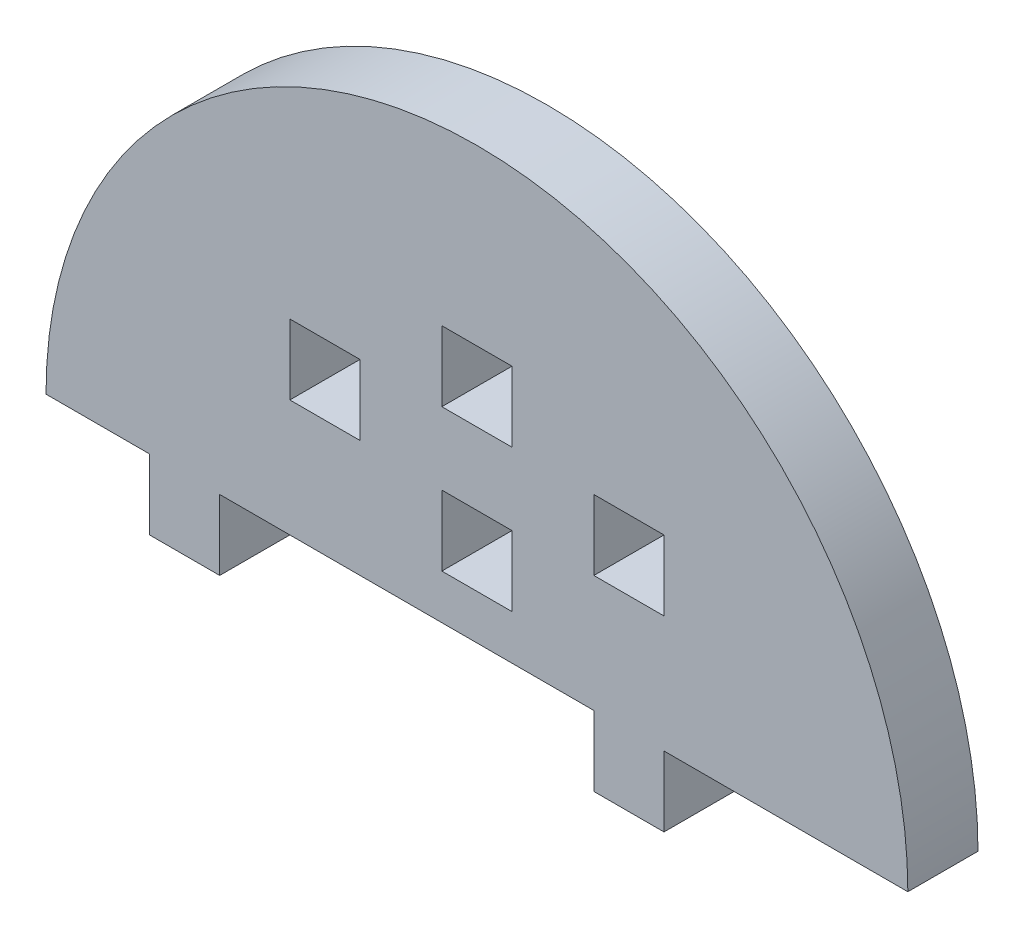
ISO-10303-21;
HEADER;
FILE_DESCRIPTION(('STEP AP214'),'2;1');
FILE_NAME('part.step','',(''),(''),'','','');
FILE_SCHEMA(('AUTOMOTIVE_DESIGN { 1 0 10303 214 1 1 1 1 }'));
ENDSEC;
DATA;
#1=APPLICATION_CONTEXT('core data for automotive mechanical design processes');
#2=APPLICATION_PROTOCOL_DEFINITION('international standard','automotive_design',2000,#1);
#3=PRODUCT_CONTEXT('',#1,'mechanical');
#4=PRODUCT('Part','Part','',(#3));
#5=PRODUCT_RELATED_PRODUCT_CATEGORY('part','',(#4));
#6=PRODUCT_DEFINITION_FORMATION('','',#4);
#7=PRODUCT_DEFINITION_CONTEXT('part definition',#1,'design');
#8=PRODUCT_DEFINITION('design','',#6,#7);
#9=PRODUCT_DEFINITION_SHAPE('','',#8);
#10=(LENGTH_UNIT() NAMED_UNIT(*) SI_UNIT(.MILLI.,.METRE.));
#11=(NAMED_UNIT(*) PLANE_ANGLE_UNIT() SI_UNIT($,.RADIAN.));
#12=(NAMED_UNIT(*) SI_UNIT($,.STERADIAN.) SOLID_ANGLE_UNIT());
#13=UNCERTAINTY_MEASURE_WITH_UNIT(LENGTH_MEASURE(1.E-05),#10,'distance_accuracy_value','');
#14=(GEOMETRIC_REPRESENTATION_CONTEXT(3) GLOBAL_UNCERTAINTY_ASSIGNED_CONTEXT((#13)) GLOBAL_UNIT_ASSIGNED_CONTEXT((#10,
#11,#12)) REPRESENTATION_CONTEXT('',''));
#15=CARTESIAN_POINT('',(0.,0.,0.));
#16=DIRECTION('',(0.,0.,1.));
#17=DIRECTION('',(1.,0.,0.));
#18=AXIS2_PLACEMENT_3D('',#15,#16,#17);
#19=CARTESIAN_POINT('',(3418.74409993076,1203.66051271851,6.));
#20=DIRECTION('',(0.,0.,1.));
#21=DIRECTION('',(1.,0.,0.));
#22=AXIS2_PLACEMENT_3D('',#19,#20,#21);
#23=PLANE('',#22);
#24=DIRECTION('',(0.,1.,0.));
#25=VECTOR('',#24,1.);
#26=CARTESIAN_POINT('',(3428.74409993076,0.,6.));
#27=LINE('',#26,#25);
#28=CARTESIAN_POINT('',(3428.74409993076,1213.66051271851,6.));
#29=VERTEX_POINT('',#28);
#30=CARTESIAN_POINT('',(3428.74409993076,1219.66051271851,6.));
#31=VERTEX_POINT('',#30);
#32=EDGE_CURVE('E393',#29,#31,#27,.T.);
#33=ORIENTED_EDGE('',*,*,#32,.T.);
#34=DIRECTION('',(1.,0.,0.));
#35=VECTOR('',#34,1.);
#36=CARTESIAN_POINT('',(0.,1219.66051271851,6.));
#37=LINE('',#36,#35);
#38=CARTESIAN_POINT('',(3434.74409993076,1219.66051271851,6.));
#39=VERTEX_POINT('',#38);
#40=EDGE_CURVE('E406',#31,#39,#37,.T.);
#41=ORIENTED_EDGE('',*,*,#40,.T.);
#42=DIRECTION('',(0.,-1.,0.));
#43=VECTOR('',#42,1.);
#44=CARTESIAN_POINT('',(3434.74409993076,0.,6.));
#45=LINE('',#44,#43);
#46=CARTESIAN_POINT('',(3434.74409993076,1213.66051271851,6.));
#47=VERTEX_POINT('',#46);
#48=EDGE_CURVE('E223',#39,#47,#45,.T.);
#49=ORIENTED_EDGE('',*,*,#48,.T.);
#50=DIRECTION('',(-1.,0.,0.));
#51=VECTOR('',#50,1.);
#52=CARTESIAN_POINT('',(0.,1213.66051271851,6.));
#53=LINE('',#52,#51);
#54=EDGE_CURVE('E385',#47,#29,#53,.T.);
#55=ORIENTED_EDGE('',*,*,#54,.T.);
#56=EDGE_LOOP('',(#33,#41,#49,#55));
#57=FACE_BOUND('',#56,.T.);
#58=DIRECTION('',(0.,1.,0.));
#59=VECTOR('',#58,1.);
#60=CARTESIAN_POINT('',(3415.74409993076,0.,6.));
#61=LINE('',#60,#59);
#62=CARTESIAN_POINT('',(3415.74409993076,1219.66051271851,6.));
#63=VERTEX_POINT('',#62);
#64=CARTESIAN_POINT('',(3415.74409993076,1225.66051271851,6.));
#65=VERTEX_POINT('',#64);
#66=EDGE_CURVE('E472',#63,#65,#61,.T.);
#67=ORIENTED_EDGE('',*,*,#66,.T.);
#68=DIRECTION('',(1.,0.,0.));
#69=VECTOR('',#68,1.);
#70=CARTESIAN_POINT('',(0.,1225.66051271851,6.));
#71=LINE('',#70,#69);
#72=CARTESIAN_POINT('',(3421.74409993076,1225.66051271851,6.));
#73=VERTEX_POINT('',#72);
#74=EDGE_CURVE('E485',#65,#73,#71,.T.);
#75=ORIENTED_EDGE('',*,*,#74,.T.);
#76=DIRECTION('',(0.,-1.,0.));
#77=VECTOR('',#76,1.);
#78=CARTESIAN_POINT('',(3421.74409993076,0.,6.));
#79=LINE('',#78,#77);
#80=CARTESIAN_POINT('',(3421.74409993076,1219.66051271851,6.));
#81=VERTEX_POINT('',#80);
#82=EDGE_CURVE('E481',#73,#81,#79,.T.);
#83=ORIENTED_EDGE('',*,*,#82,.T.);
#84=DIRECTION('',(-1.,0.,0.));
#85=VECTOR('',#84,1.);
#86=CARTESIAN_POINT('',(0.,1219.66051271851,6.));
#87=LINE('',#86,#85);
#88=EDGE_CURVE('E476',#81,#63,#87,.T.);
#89=ORIENTED_EDGE('',*,*,#88,.T.);
#90=EDGE_LOOP('',(#67,#75,#83,#89));
#91=FACE_BOUND('',#90,.T.);
#92=DIRECTION('',(1.,0.,0.));
#93=VECTOR('',#92,1.);
#94=CARTESIAN_POINT('',(3434.74409993076,1203.66051271851,6.));
#95=LINE('',#94,#93);
#96=CARTESIAN_POINT('',(3434.74409993076,1203.66051271851,6.));
#97=VERTEX_POINT('',#96);
#98=CARTESIAN_POINT('',(3455.6012427879,1203.66051271851,6.));
#99=VERTEX_POINT('',#98);
#100=EDGE_CURVE('E559',#97,#99,#95,.T.);
#101=ORIENTED_EDGE('',*,*,#100,.T.);
#102=CARTESIAN_POINT('',(3418.74409993076,1203.66051271851,6.));
#103=DIRECTION('',(0.,0.,1.));
#104=DIRECTION('',(1.,0.,0.));
#105=AXIS2_PLACEMENT_3D('',#102,#103,#104);
#106=CIRCLE('',#105,36.8571428571414);
#107=CARTESIAN_POINT('',(3381.88695707362,1203.66051271851,6.));
#108=VERTEX_POINT('',#107);
#109=EDGE_CURVE('E563',#99,#108,#106,.T.);
#110=ORIENTED_EDGE('',*,*,#109,.T.);
#111=DIRECTION('',(-1.,0.,0.));
#112=VECTOR('',#111,1.);
#113=CARTESIAN_POINT('',(3390.74409993076,1203.66051271851,6.));
#114=LINE('',#113,#112);
#115=CARTESIAN_POINT('',(3390.74409993076,1203.66051271851,6.));
#116=VERTEX_POINT('',#115);
#117=EDGE_CURVE('E567',#116,#108,#114,.T.);
#118=ORIENTED_EDGE('',*,*,#117,.F.);
#119=DIRECTION('',(0.,1.,0.));
#120=VECTOR('',#119,1.);
#121=CARTESIAN_POINT('',(3390.74409993076,1197.66051271851,6.));
#122=LINE('',#121,#120);
#123=CARTESIAN_POINT('',(3390.74409993076,1197.66051271851,6.));
#124=VERTEX_POINT('',#123);
#125=EDGE_CURVE('E571',#124,#116,#122,.T.);
#126=ORIENTED_EDGE('',*,*,#125,.F.);
#127=DIRECTION('',(-1.,0.,0.));
#128=VECTOR('',#127,1.);
#129=CARTESIAN_POINT('',(3396.74409993076,1197.66051271851,6.));
#130=LINE('',#129,#128);
#131=CARTESIAN_POINT('',(3396.74409993076,1197.66051271851,6.));
#132=VERTEX_POINT('',#131);
#133=EDGE_CURVE('E575',#132,#124,#130,.T.);
#134=ORIENTED_EDGE('',*,*,#133,.F.);
#135=DIRECTION('',(0.,-1.,0.));
#136=VECTOR('',#135,1.);
#137=CARTESIAN_POINT('',(3396.74409993076,1203.66051271851,6.));
#138=LINE('',#137,#136);
#139=CARTESIAN_POINT('',(3396.74409993076,1203.66051271851,6.));
#140=VERTEX_POINT('',#139);
#141=EDGE_CURVE('E579',#140,#132,#138,.T.);
#142=ORIENTED_EDGE('',*,*,#141,.F.);
#143=DIRECTION('',(1.,0.,0.));
#144=VECTOR('',#143,1.);
#145=CARTESIAN_POINT('',(3396.74409993076,1203.66051271851,6.));
#146=LINE('',#145,#144);
#147=CARTESIAN_POINT('',(3428.74409993076,1203.66051271851,6.));
#148=VERTEX_POINT('',#147);
#149=EDGE_CURVE('E583',#140,#148,#146,.T.);
#150=ORIENTED_EDGE('',*,*,#149,.T.);
#151=DIRECTION('',(0.,-1.,0.));
#152=VECTOR('',#151,1.);
#153=CARTESIAN_POINT('',(3428.74409993076,1203.66051271851,6.));
#154=LINE('',#153,#152);
#155=CARTESIAN_POINT('',(3428.74409993076,1197.66051271851,6.));
#156=VERTEX_POINT('',#155);
#157=EDGE_CURVE('E586',#148,#156,#154,.T.);
#158=ORIENTED_EDGE('',*,*,#157,.T.);
#159=DIRECTION('',(1.,0.,0.));
#160=VECTOR('',#159,1.);
#161=CARTESIAN_POINT('',(3428.74409993076,1197.66051271851,6.));
#162=LINE('',#161,#160);
#163=CARTESIAN_POINT('',(3434.74409993076,1197.66051271851,6.));
#164=VERTEX_POINT('',#163);
#165=EDGE_CURVE('E589',#156,#164,#162,.T.);
#166=ORIENTED_EDGE('',*,*,#165,.T.);
#167=DIRECTION('',(0.,1.,0.));
#168=VECTOR('',#167,1.);
#169=CARTESIAN_POINT('',(3434.74409993076,1197.66051271851,6.));
#170=LINE('',#169,#168);
#171=EDGE_CURVE('E592',#164,#97,#170,.T.);
#172=ORIENTED_EDGE('',*,*,#171,.T.);
#173=EDGE_LOOP('',(#101,#110,#118,#126,#134,#142,#150,#158,#166,#172));
#174=FACE_BOUND('',#173,.T.);
#175=DIRECTION('',(0.,1.,0.));
#176=VECTOR('',#175,1.);
#177=CARTESIAN_POINT('',(3408.74409993076,0.,6.));
#178=LINE('',#177,#176);
#179=CARTESIAN_POINT('',(3408.74409993076,1213.66051271851,6.));
#180=VERTEX_POINT('',#179);
#181=CARTESIAN_POINT('',(3408.74409993076,1219.66051271851,6.));
#182=VERTEX_POINT('',#181);
#183=EDGE_CURVE('E519',#180,#182,#178,.T.);
#184=ORIENTED_EDGE('',*,*,#183,.F.);
#185=DIRECTION('',(1.,0.,0.));
#186=VECTOR('',#185,1.);
#187=CARTESIAN_POINT('',(0.,1213.66051271851,6.));
#188=LINE('',#187,#186);
#189=CARTESIAN_POINT('',(3402.74409993076,1213.66051271851,6.));
#190=VERTEX_POINT('',#189);
#191=EDGE_CURVE('E516',#190,#180,#188,.T.);
#192=ORIENTED_EDGE('',*,*,#191,.F.);
#193=DIRECTION('',(0.,-1.,0.));
#194=VECTOR('',#193,1.);
#195=CARTESIAN_POINT('',(3402.74409993076,0.,6.));
#196=LINE('',#195,#194);
#197=CARTESIAN_POINT('',(3402.74409993076,1219.66051271851,6.));
#198=VERTEX_POINT('',#197);
#199=EDGE_CURVE('E527',#198,#190,#196,.T.);
#200=ORIENTED_EDGE('',*,*,#199,.F.);
#201=DIRECTION('',(-1.,0.,0.));
#202=VECTOR('',#201,1.);
#203=CARTESIAN_POINT('',(0.,1219.66051271851,6.));
#204=LINE('',#203,#202);
#205=EDGE_CURVE('E523',#182,#198,#204,.T.);
#206=ORIENTED_EDGE('',*,*,#205,.F.);
#207=EDGE_LOOP('',(#184,#192,#200,#206));
#208=FACE_BOUND('',#207,.T.);
#209=DIRECTION('',(0.,-1.,0.));
#210=VECTOR('',#209,1.);
#211=CARTESIAN_POINT('',(3415.74409993076,0.,6.));
#212=LINE('',#211,#210);
#213=CARTESIAN_POINT('',(3415.74409993076,1213.48497155193,6.));
#214=VERTEX_POINT('',#213);
#215=CARTESIAN_POINT('',(3415.74409993076,1207.48497155193,6.));
#216=VERTEX_POINT('',#215);
#217=EDGE_CURVE('E432',#214,#216,#212,.T.);
#218=ORIENTED_EDGE('',*,*,#217,.F.);
#219=DIRECTION('',(-1.,0.,0.));
#220=VECTOR('',#219,1.);
#221=CARTESIAN_POINT('',(0.,1213.48497155193,6.));
#222=LINE('',#221,#220);
#223=CARTESIAN_POINT('',(3421.74409993076,1213.48497155193,6.));
#224=VERTEX_POINT('',#223);
#225=EDGE_CURVE('E429',#224,#214,#222,.T.);
#226=ORIENTED_EDGE('',*,*,#225,.F.);
#227=DIRECTION('',(0.,1.,0.));
#228=VECTOR('',#227,1.);
#229=CARTESIAN_POINT('',(3421.74409993076,0.,6.));
#230=LINE('',#229,#228);
#231=CARTESIAN_POINT('',(3421.74409993076,1207.48497155193,6.));
#232=VERTEX_POINT('',#231);
#233=EDGE_CURVE('E440',#232,#224,#230,.T.);
#234=ORIENTED_EDGE('',*,*,#233,.F.);
#235=DIRECTION('',(1.,0.,0.));
#236=VECTOR('',#235,1.);
#237=CARTESIAN_POINT('',(0.,1207.48497155193,6.));
#238=LINE('',#237,#236);
#239=EDGE_CURVE('E436',#216,#232,#238,.T.);
#240=ORIENTED_EDGE('',*,*,#239,.F.);
#241=EDGE_LOOP('',(#218,#226,#234,#240));
#242=FACE_BOUND('',#241,.T.);
#243=ADVANCED_FACE('F207',(#57,#91,#174,#208,#242),#23,.T.);
#244=CARTESIAN_POINT('',(3418.74409993076,1203.66051271851,0.));
#245=DIRECTION('',(0.,0.,1.));
#246=DIRECTION('',(1.,0.,0.));
#247=AXIS2_PLACEMENT_3D('',#244,#245,#246);
#248=PLANE('',#247);
#249=DIRECTION('',(1.,0.,0.));
#250=VECTOR('',#249,1.);
#251=CARTESIAN_POINT('',(0.,1219.66051271851,0.));
#252=LINE('',#251,#250);
#253=CARTESIAN_POINT('',(3428.74409993076,1219.66051271851,0.));
#254=VERTEX_POINT('',#253);
#255=CARTESIAN_POINT('',(3434.74409993076,1219.66051271851,0.));
#256=VERTEX_POINT('',#255);
#257=EDGE_CURVE('E400',#254,#256,#252,.T.);
#258=ORIENTED_EDGE('',*,*,#257,.F.);
#259=DIRECTION('',(0.,1.,0.));
#260=VECTOR('',#259,1.);
#261=CARTESIAN_POINT('',(3428.74409993076,0.,0.));
#262=LINE('',#261,#260);
#263=CARTESIAN_POINT('',(3428.74409993076,1213.66051271851,0.));
#264=VERTEX_POINT('',#263);
#265=EDGE_CURVE('E231',#264,#254,#262,.T.);
#266=ORIENTED_EDGE('',*,*,#265,.F.);
#267=DIRECTION('',(-1.,0.,0.));
#268=VECTOR('',#267,1.);
#269=CARTESIAN_POINT('',(0.,1213.66051271851,0.));
#270=LINE('',#269,#268);
#271=CARTESIAN_POINT('',(3434.74409993076,1213.66051271851,0.));
#272=VERTEX_POINT('',#271);
#273=EDGE_CURVE('E387',#272,#264,#270,.T.);
#274=ORIENTED_EDGE('',*,*,#273,.F.);
#275=DIRECTION('',(0.,-1.,0.));
#276=VECTOR('',#275,1.);
#277=CARTESIAN_POINT('',(3434.74409993076,0.,0.));
#278=LINE('',#277,#276);
#279=EDGE_CURVE('E415',#256,#272,#278,.T.);
#280=ORIENTED_EDGE('',*,*,#279,.F.);
#281=EDGE_LOOP('',(#258,#266,#274,#280));
#282=FACE_BOUND('',#281,.T.);
#283=DIRECTION('',(1.,0.,0.));
#284=VECTOR('',#283,1.);
#285=CARTESIAN_POINT('',(0.,1213.66051271851,0.));
#286=LINE('',#285,#284);
#287=CARTESIAN_POINT('',(3402.74409993076,1213.66051271851,0.));
#288=VERTEX_POINT('',#287);
#289=CARTESIAN_POINT('',(3408.74409993076,1213.66051271851,0.));
#290=VERTEX_POINT('',#289);
#291=EDGE_CURVE('E515',#288,#290,#286,.T.);
#292=ORIENTED_EDGE('',*,*,#291,.T.);
#293=DIRECTION('',(0.,1.,0.));
#294=VECTOR('',#293,1.);
#295=CARTESIAN_POINT('',(3408.74409993076,0.,0.));
#296=LINE('',#295,#294);
#297=CARTESIAN_POINT('',(3408.74409993076,1219.66051271851,0.));
#298=VERTEX_POINT('',#297);
#299=EDGE_CURVE('E534',#290,#298,#296,.T.);
#300=ORIENTED_EDGE('',*,*,#299,.T.);
#301=DIRECTION('',(-1.,0.,0.));
#302=VECTOR('',#301,1.);
#303=CARTESIAN_POINT('',(0.,1219.66051271851,0.));
#304=LINE('',#303,#302);
#305=CARTESIAN_POINT('',(3402.74409993076,1219.66051271851,0.));
#306=VERTEX_POINT('',#305);
#307=EDGE_CURVE('E538',#298,#306,#304,.T.);
#308=ORIENTED_EDGE('',*,*,#307,.T.);
#309=DIRECTION('',(0.,-1.,0.));
#310=VECTOR('',#309,1.);
#311=CARTESIAN_POINT('',(3402.74409993076,0.,0.));
#312=LINE('',#311,#310);
#313=EDGE_CURVE('E520',#306,#288,#312,.T.);
#314=ORIENTED_EDGE('',*,*,#313,.T.);
#315=EDGE_LOOP('',(#292,#300,#308,#314));
#316=FACE_BOUND('',#315,.T.);
#317=DIRECTION('',(1.,0.,0.));
#318=VECTOR('',#317,1.);
#319=CARTESIAN_POINT('',(3434.74409993076,1203.66051271851,0.));
#320=LINE('',#319,#318);
#321=CARTESIAN_POINT('',(3434.74409993076,1203.66051271851,0.));
#322=VERTEX_POINT('',#321);
#323=CARTESIAN_POINT('',(3455.6012427879,1203.66051271851,0.));
#324=VERTEX_POINT('',#323);
#325=EDGE_CURVE('E558',#322,#324,#320,.T.);
#326=ORIENTED_EDGE('',*,*,#325,.F.);
#327=DIRECTION('',(0.,1.,0.));
#328=VECTOR('',#327,1.);
#329=CARTESIAN_POINT('',(3434.74409993076,1197.66051271851,0.));
#330=LINE('',#329,#328);
#331=CARTESIAN_POINT('',(3434.74409993076,1197.66051271851,0.));
#332=VERTEX_POINT('',#331);
#333=EDGE_CURVE('E564',#332,#322,#330,.T.);
#334=ORIENTED_EDGE('',*,*,#333,.F.);
#335=DIRECTION('',(1.,0.,0.));
#336=VECTOR('',#335,1.);
#337=CARTESIAN_POINT('',(3428.74409993076,1197.66051271851,0.));
#338=LINE('',#337,#336);
#339=CARTESIAN_POINT('',(3428.74409993076,1197.66051271851,0.));
#340=VERTEX_POINT('',#339);
#341=EDGE_CURVE('E625',#340,#332,#338,.T.);
#342=ORIENTED_EDGE('',*,*,#341,.F.);
#343=DIRECTION('',(0.,-1.,0.));
#344=VECTOR('',#343,1.);
#345=CARTESIAN_POINT('',(3428.74409993076,1203.66051271851,0.));
#346=LINE('',#345,#344);
#347=CARTESIAN_POINT('',(3428.74409993076,1203.66051271851,0.));
#348=VERTEX_POINT('',#347);
#349=EDGE_CURVE('E622',#348,#340,#346,.T.);
#350=ORIENTED_EDGE('',*,*,#349,.F.);
#351=DIRECTION('',(1.,0.,0.));
#352=VECTOR('',#351,1.);
#353=CARTESIAN_POINT('',(3396.74409993076,1203.66051271851,0.));
#354=LINE('',#353,#352);
#355=CARTESIAN_POINT('',(3396.74409993076,1203.66051271851,0.));
#356=VERTEX_POINT('',#355);
#357=EDGE_CURVE('E619',#356,#348,#354,.T.);
#358=ORIENTED_EDGE('',*,*,#357,.F.);
#359=DIRECTION('',(0.,-1.,0.));
#360=VECTOR('',#359,1.);
#361=CARTESIAN_POINT('',(3396.74409993076,1203.66051271851,0.));
#362=LINE('',#361,#360);
#363=CARTESIAN_POINT('',(3396.74409993076,1197.66051271851,0.));
#364=VERTEX_POINT('',#363);
#365=EDGE_CURVE('E615',#356,#364,#362,.T.);
#366=ORIENTED_EDGE('',*,*,#365,.T.);
#367=DIRECTION('',(-1.,0.,0.));
#368=VECTOR('',#367,1.);
#369=CARTESIAN_POINT('',(3396.74409993076,1197.66051271851,0.));
#370=LINE('',#369,#368);
#371=CARTESIAN_POINT('',(3390.74409993076,1197.66051271851,0.));
#372=VERTEX_POINT('',#371);
#373=EDGE_CURVE('E611',#364,#372,#370,.T.);
#374=ORIENTED_EDGE('',*,*,#373,.T.);
#375=DIRECTION('',(0.,1.,0.));
#376=VECTOR('',#375,1.);
#377=CARTESIAN_POINT('',(3390.74409993076,1197.66051271851,0.));
#378=LINE('',#377,#376);
#379=CARTESIAN_POINT('',(3390.74409993076,1203.66051271851,0.));
#380=VERTEX_POINT('',#379);
#381=EDGE_CURVE('E607',#372,#380,#378,.T.);
#382=ORIENTED_EDGE('',*,*,#381,.T.);
#383=DIRECTION('',(-1.,0.,0.));
#384=VECTOR('',#383,1.);
#385=CARTESIAN_POINT('',(3390.74409993076,1203.66051271851,0.));
#386=LINE('',#385,#384);
#387=CARTESIAN_POINT('',(3381.88695707362,1203.66051271851,0.));
#388=VERTEX_POINT('',#387);
#389=EDGE_CURVE('E603',#380,#388,#386,.T.);
#390=ORIENTED_EDGE('',*,*,#389,.T.);
#391=CARTESIAN_POINT('',(3418.74409993076,1203.66051271851,0.));
#392=DIRECTION('',(0.,0.,1.));
#393=DIRECTION('',(1.,0.,0.));
#394=AXIS2_PLACEMENT_3D('',#391,#392,#393);
#395=CIRCLE('',#394,36.8571428571414);
#396=EDGE_CURVE('E599',#324,#388,#395,.T.);
#397=ORIENTED_EDGE('',*,*,#396,.F.);
#398=EDGE_LOOP('',(#326,#334,#342,#350,#358,#366,#374,#382,#390,#397));
#399=FACE_BOUND('',#398,.T.);
#400=DIRECTION('',(1.,0.,0.));
#401=VECTOR('',#400,1.);
#402=CARTESIAN_POINT('',(0.,1225.66051271851,0.));
#403=LINE('',#402,#401);
#404=CARTESIAN_POINT('',(3415.74409993076,1225.66051271851,0.));
#405=VERTEX_POINT('',#404);
#406=CARTESIAN_POINT('',(3421.74409993076,1225.66051271851,0.));
#407=VERTEX_POINT('',#406);
#408=EDGE_CURVE('E477',#405,#407,#403,.T.);
#409=ORIENTED_EDGE('',*,*,#408,.F.);
#410=DIRECTION('',(0.,1.,0.));
#411=VECTOR('',#410,1.);
#412=CARTESIAN_POINT('',(3415.74409993076,0.,0.));
#413=LINE('',#412,#411);
#414=CARTESIAN_POINT('',(3415.74409993076,1219.66051271851,0.));
#415=VERTEX_POINT('',#414);
#416=EDGE_CURVE('E471',#415,#405,#413,.T.);
#417=ORIENTED_EDGE('',*,*,#416,.F.);
#418=DIRECTION('',(-1.,0.,0.));
#419=VECTOR('',#418,1.);
#420=CARTESIAN_POINT('',(0.,1219.66051271851,0.));
#421=LINE('',#420,#419);
#422=CARTESIAN_POINT('',(3421.74409993076,1219.66051271851,0.));
#423=VERTEX_POINT('',#422);
#424=EDGE_CURVE('E492',#423,#415,#421,.T.);
#425=ORIENTED_EDGE('',*,*,#424,.F.);
#426=DIRECTION('',(0.,-1.,0.));
#427=VECTOR('',#426,1.);
#428=CARTESIAN_POINT('',(3421.74409993076,0.,0.));
#429=LINE('',#428,#427);
#430=EDGE_CURVE('E496',#407,#423,#429,.T.);
#431=ORIENTED_EDGE('',*,*,#430,.F.);
#432=EDGE_LOOP('',(#409,#417,#425,#431));
#433=FACE_BOUND('',#432,.T.);
#434=DIRECTION('',(-1.,0.,0.));
#435=VECTOR('',#434,1.);
#436=CARTESIAN_POINT('',(0.,1213.48497155193,0.));
#437=LINE('',#436,#435);
#438=CARTESIAN_POINT('',(3421.74409993076,1213.48497155193,0.));
#439=VERTEX_POINT('',#438);
#440=CARTESIAN_POINT('',(3415.74409993076,1213.48497155193,0.));
#441=VERTEX_POINT('',#440);
#442=EDGE_CURVE('E389',#439,#441,#437,.T.);
#443=ORIENTED_EDGE('',*,*,#442,.T.);
#444=DIRECTION('',(0.,-1.,0.));
#445=VECTOR('',#444,1.);
#446=CARTESIAN_POINT('',(3415.74409993076,0.,0.));
#447=LINE('',#446,#445);
#448=CARTESIAN_POINT('',(3415.74409993076,1207.48497155193,0.));
#449=VERTEX_POINT('',#448);
#450=EDGE_CURVE('E447',#441,#449,#447,.T.);
#451=ORIENTED_EDGE('',*,*,#450,.T.);
#452=DIRECTION('',(1.,0.,0.));
#453=VECTOR('',#452,1.);
#454=CARTESIAN_POINT('',(0.,1207.48497155193,0.));
#455=LINE('',#454,#453);
#456=CARTESIAN_POINT('',(3421.74409993076,1207.48497155193,0.));
#457=VERTEX_POINT('',#456);
#458=EDGE_CURVE('E451',#449,#457,#455,.T.);
#459=ORIENTED_EDGE('',*,*,#458,.T.);
#460=DIRECTION('',(0.,1.,0.));
#461=VECTOR('',#460,1.);
#462=CARTESIAN_POINT('',(3421.74409993076,0.,0.));
#463=LINE('',#462,#461);
#464=EDGE_CURVE('E433',#457,#439,#463,.T.);
#465=ORIENTED_EDGE('',*,*,#464,.T.);
#466=EDGE_LOOP('',(#443,#451,#459,#465));
#467=FACE_BOUND('',#466,.T.);
#468=ADVANCED_FACE('F667',(#282,#316,#399,#433,#467),#248,.F.);
#469=CARTESIAN_POINT('',(3434.74409993076,1203.66051271851,6.));
#470=DIRECTION('',(0.,1.,0.));
#471=DIRECTION('',(0.,0.,1.));
#472=AXIS2_PLACEMENT_3D('',#469,#470,#471);
#473=PLANE('',#472);
#474=ORIENTED_EDGE('',*,*,#325,.T.);
#475=DIRECTION('',(0.,0.,-1.));
#476=VECTOR('',#475,1.);
#477=CARTESIAN_POINT('',(3455.6012427879,1203.66051271851,6.));
#478=LINE('',#477,#476);
#479=EDGE_CURVE('E12',#99,#324,#478,.T.);
#480=ORIENTED_EDGE('',*,*,#479,.F.);
#481=ORIENTED_EDGE('',*,*,#100,.F.);
#482=DIRECTION('',(0.,0.,-1.));
#483=VECTOR('',#482,1.);
#484=CARTESIAN_POINT('',(3434.74409993076,1203.66051271851,6.));
#485=LINE('',#484,#483);
#486=EDGE_CURVE('E595',#97,#322,#485,.T.);
#487=ORIENTED_EDGE('',*,*,#486,.T.);
#488=EDGE_LOOP('',(#474,#480,#481,#487));
#489=FACE_BOUND('',#488,.T.);
#490=ADVANCED_FACE('F209',(#489),#473,.F.);
#491=CARTESIAN_POINT('',(3418.74409993076,1203.66051271851,6.));
#492=DIRECTION('',(0.,0.,-1.));
#493=DIRECTION('',(-1.,0.,0.));
#494=AXIS2_PLACEMENT_3D('',#491,#492,#493);
#495=CYLINDRICAL_SURFACE('',#494,36.8571428571414);
#496=ORIENTED_EDGE('',*,*,#396,.T.);
#497=DIRECTION('',(0.,0.,-1.));
#498=VECTOR('',#497,1.);
#499=CARTESIAN_POINT('',(3381.88695707362,1203.66051271851,6.));
#500=LINE('',#499,#498);
#501=EDGE_CURVE('E216',#108,#388,#500,.T.);
#502=ORIENTED_EDGE('',*,*,#501,.F.);
#503=ORIENTED_EDGE('',*,*,#109,.F.);
#504=ORIENTED_EDGE('',*,*,#479,.T.);
#505=EDGE_LOOP('',(#496,#502,#503,#504));
#506=FACE_BOUND('',#505,.T.);
#507=ADVANCED_FACE('F663',(#506),#495,.T.);
#508=CARTESIAN_POINT('',(3390.74409993076,1203.66051271851,6.));
#509=DIRECTION('',(0.,-1.,0.));
#510=DIRECTION('',(0.,0.,-1.));
#511=AXIS2_PLACEMENT_3D('',#508,#509,#510);
#512=PLANE('',#511);
#513=ORIENTED_EDGE('',*,*,#389,.F.);
#514=DIRECTION('',(0.,0.,-1.));
#515=VECTOR('',#514,1.);
#516=CARTESIAN_POINT('',(3390.74409993076,1203.66051271851,6.));
#517=LINE('',#516,#515);
#518=EDGE_CURVE('E654',#116,#380,#517,.T.);
#519=ORIENTED_EDGE('',*,*,#518,.F.);
#520=ORIENTED_EDGE('',*,*,#117,.T.);
#521=ORIENTED_EDGE('',*,*,#501,.T.);
#522=EDGE_LOOP('',(#513,#519,#520,#521));
#523=FACE_BOUND('',#522,.T.);
#524=ADVANCED_FACE('F660',(#523),#512,.T.);
#525=CARTESIAN_POINT('',(3390.74409993076,1197.66051271851,6.));
#526=DIRECTION('',(-1.,0.,0.));
#527=DIRECTION('',(0.,0.,1.));
#528=AXIS2_PLACEMENT_3D('',#525,#526,#527);
#529=PLANE('',#528);
#530=ORIENTED_EDGE('',*,*,#381,.F.);
#531=DIRECTION('',(0.,0.,-1.));
#532=VECTOR('',#531,1.);
#533=CARTESIAN_POINT('',(3390.74409993076,1197.66051271851,6.));
#534=LINE('',#533,#532);
#535=EDGE_CURVE('E651',#124,#372,#534,.T.);
#536=ORIENTED_EDGE('',*,*,#535,.F.);
#537=ORIENTED_EDGE('',*,*,#125,.T.);
#538=ORIENTED_EDGE('',*,*,#518,.T.);
#539=EDGE_LOOP('',(#530,#536,#537,#538));
#540=FACE_BOUND('',#539,.T.);
#541=ADVANCED_FACE('F672',(#540),#529,.T.);
#542=CARTESIAN_POINT('',(3396.74409993076,1197.66051271851,6.));
#543=DIRECTION('',(0.,-1.,0.));
#544=DIRECTION('',(0.,0.,-1.));
#545=AXIS2_PLACEMENT_3D('',#542,#543,#544);
#546=PLANE('',#545);
#547=ORIENTED_EDGE('',*,*,#373,.F.);
#548=DIRECTION('',(0.,0.,-1.));
#549=VECTOR('',#548,1.);
#550=CARTESIAN_POINT('',(3396.74409993076,1197.66051271851,6.));
#551=LINE('',#550,#549);
#552=EDGE_CURVE('E648',#132,#364,#551,.T.);
#553=ORIENTED_EDGE('',*,*,#552,.F.);
#554=ORIENTED_EDGE('',*,*,#133,.T.);
#555=ORIENTED_EDGE('',*,*,#535,.T.);
#556=EDGE_LOOP('',(#547,#553,#554,#555));
#557=FACE_BOUND('',#556,.T.);
#558=ADVANCED_FACE('F703',(#557),#546,.T.);
#559=CARTESIAN_POINT('',(3396.74409993076,1203.66051271851,6.));
#560=DIRECTION('',(1.,0.,0.));
#561=DIRECTION('',(0.,0.,-1.));
#562=AXIS2_PLACEMENT_3D('',#559,#560,#561);
#563=PLANE('',#562);
#564=ORIENTED_EDGE('',*,*,#365,.F.);
#565=DIRECTION('',(0.,0.,-1.));
#566=VECTOR('',#565,1.);
#567=CARTESIAN_POINT('',(3396.74409993076,1203.66051271851,6.));
#568=LINE('',#567,#566);
#569=EDGE_CURVE('E645',#140,#356,#568,.T.);
#570=ORIENTED_EDGE('',*,*,#569,.F.);
#571=ORIENTED_EDGE('',*,*,#141,.T.);
#572=ORIENTED_EDGE('',*,*,#552,.T.);
#573=EDGE_LOOP('',(#564,#570,#571,#572));
#574=FACE_BOUND('',#573,.T.);
#575=ADVANCED_FACE('F699',(#574),#563,.T.);
#576=CARTESIAN_POINT('',(3396.74409993076,1203.66051271851,6.));
#577=DIRECTION('',(0.,1.,0.));
#578=DIRECTION('',(0.,0.,1.));
#579=AXIS2_PLACEMENT_3D('',#576,#577,#578);
#580=PLANE('',#579);
#581=ORIENTED_EDGE('',*,*,#357,.T.);
#582=DIRECTION('',(0.,0.,-1.));
#583=VECTOR('',#582,1.);
#584=CARTESIAN_POINT('',(3428.74409993076,1203.66051271851,6.));
#585=LINE('',#584,#583);
#586=EDGE_CURVE('E641',#148,#348,#585,.T.);
#587=ORIENTED_EDGE('',*,*,#586,.F.);
#588=ORIENTED_EDGE('',*,*,#149,.F.);
#589=ORIENTED_EDGE('',*,*,#569,.T.);
#590=EDGE_LOOP('',(#581,#587,#588,#589));
#591=FACE_BOUND('',#590,.T.);
#592=ADVANCED_FACE('F704',(#591),#580,.F.);
#593=CARTESIAN_POINT('',(3428.74409993076,1203.66051271851,6.));
#594=DIRECTION('',(1.,0.,0.));
#595=DIRECTION('',(0.,0.,-1.));
#596=AXIS2_PLACEMENT_3D('',#593,#594,#595);
#597=PLANE('',#596);
#598=ORIENTED_EDGE('',*,*,#349,.T.);
#599=DIRECTION('',(0.,0.,-1.));
#600=VECTOR('',#599,1.);
#601=CARTESIAN_POINT('',(3428.74409993076,1197.66051271851,6.));
#602=LINE('',#601,#600);
#603=EDGE_CURVE('E637',#156,#340,#602,.T.);
#604=ORIENTED_EDGE('',*,*,#603,.F.);
#605=ORIENTED_EDGE('',*,*,#157,.F.);
#606=ORIENTED_EDGE('',*,*,#586,.T.);
#607=EDGE_LOOP('',(#598,#604,#605,#606));
#608=FACE_BOUND('',#607,.T.);
#609=ADVANCED_FACE('F693',(#608),#597,.F.);
#610=CARTESIAN_POINT('',(3428.74409993076,1197.66051271851,6.));
#611=DIRECTION('',(0.,1.,0.));
#612=DIRECTION('',(0.,0.,1.));
#613=AXIS2_PLACEMENT_3D('',#610,#611,#612);
#614=PLANE('',#613);
#615=ORIENTED_EDGE('',*,*,#341,.T.);
#616=DIRECTION('',(0.,0.,-1.));
#617=VECTOR('',#616,1.);
#618=CARTESIAN_POINT('',(3434.74409993076,1197.66051271851,6.));
#619=LINE('',#618,#617);
#620=EDGE_CURVE('E633',#164,#332,#619,.T.);
#621=ORIENTED_EDGE('',*,*,#620,.F.);
#622=ORIENTED_EDGE('',*,*,#165,.F.);
#623=ORIENTED_EDGE('',*,*,#603,.T.);
#624=EDGE_LOOP('',(#615,#621,#622,#623));
#625=FACE_BOUND('',#624,.T.);
#626=ADVANCED_FACE('F689',(#625),#614,.F.);
#627=CARTESIAN_POINT('',(3434.74409993076,1197.66051271851,6.));
#628=DIRECTION('',(-1.,0.,0.));
#629=DIRECTION('',(0.,0.,1.));
#630=AXIS2_PLACEMENT_3D('',#627,#628,#629);
#631=PLANE('',#630);
#632=ORIENTED_EDGE('',*,*,#333,.T.);
#633=ORIENTED_EDGE('',*,*,#486,.F.);
#634=ORIENTED_EDGE('',*,*,#171,.F.);
#635=ORIENTED_EDGE('',*,*,#620,.T.);
#636=EDGE_LOOP('',(#632,#633,#634,#635));
#637=FACE_BOUND('',#636,.T.);
#638=ADVANCED_FACE('F685',(#637),#631,.F.);
#639=CARTESIAN_POINT('',(0.,1213.66051271851,6.));
#640=DIRECTION('',(0.,1.,0.));
#641=DIRECTION('',(0.,0.,1.));
#642=AXIS2_PLACEMENT_3D('',#639,#640,#641);
#643=PLANE('',#642);
#644=ORIENTED_EDGE('',*,*,#291,.F.);
#645=DIRECTION('',(0.,0.,-1.));
#646=VECTOR('',#645,1.);
#647=CARTESIAN_POINT('',(3402.74409993076,1213.66051271851,6.));
#648=LINE('',#647,#646);
#649=EDGE_CURVE('E530',#190,#288,#648,.T.);
#650=ORIENTED_EDGE('',*,*,#649,.F.);
#651=ORIENTED_EDGE('',*,*,#191,.T.);
#652=DIRECTION('',(0.,0.,-1.));
#653=VECTOR('',#652,1.);
#654=CARTESIAN_POINT('',(3408.74409993076,1213.66051271851,6.));
#655=LINE('',#654,#653);
#656=EDGE_CURVE('E554',#180,#290,#655,.T.);
#657=ORIENTED_EDGE('',*,*,#656,.T.);
#658=EDGE_LOOP('',(#644,#650,#651,#657));
#659=FACE_BOUND('',#658,.T.);
#660=ADVANCED_FACE('F721',(#659),#643,.T.);
#661=CARTESIAN_POINT('',(3408.74409993076,0.,6.));
#662=DIRECTION('',(-1.,0.,0.));
#663=DIRECTION('',(0.,0.,1.));
#664=AXIS2_PLACEMENT_3D('',#661,#662,#663);
#665=PLANE('',#664);
#666=ORIENTED_EDGE('',*,*,#299,.F.);
#667=ORIENTED_EDGE('',*,*,#656,.F.);
#668=ORIENTED_EDGE('',*,*,#183,.T.);
#669=DIRECTION('',(0.,0.,-1.));
#670=VECTOR('',#669,1.);
#671=CARTESIAN_POINT('',(3408.74409993076,1219.66051271851,6.));
#672=LINE('',#671,#670);
#673=EDGE_CURVE('E551',#182,#298,#672,.T.);
#674=ORIENTED_EDGE('',*,*,#673,.T.);
#675=EDGE_LOOP('',(#666,#667,#668,#674));
#676=FACE_BOUND('',#675,.T.);
#677=ADVANCED_FACE('F741',(#676),#665,.T.);
#678=CARTESIAN_POINT('',(0.,1219.66051271851,6.));
#679=DIRECTION('',(0.,-1.,0.));
#680=DIRECTION('',(0.,0.,-1.));
#681=AXIS2_PLACEMENT_3D('',#678,#679,#680);
#682=PLANE('',#681);
#683=ORIENTED_EDGE('',*,*,#307,.F.);
#684=ORIENTED_EDGE('',*,*,#673,.F.);
#685=ORIENTED_EDGE('',*,*,#205,.T.);
#686=DIRECTION('',(0.,0.,-1.));
#687=VECTOR('',#686,1.);
#688=CARTESIAN_POINT('',(3402.74409993076,1219.66051271851,6.));
#689=LINE('',#688,#687);
#690=EDGE_CURVE('E548',#198,#306,#689,.T.);
#691=ORIENTED_EDGE('',*,*,#690,.T.);
#692=EDGE_LOOP('',(#683,#684,#685,#691));
#693=FACE_BOUND('',#692,.T.);
#694=ADVANCED_FACE('F748',(#693),#682,.T.);
#695=CARTESIAN_POINT('',(3402.74409993076,0.,6.));
#696=DIRECTION('',(1.,0.,0.));
#697=DIRECTION('',(0.,0.,-1.));
#698=AXIS2_PLACEMENT_3D('',#695,#696,#697);
#699=PLANE('',#698);
#700=ORIENTED_EDGE('',*,*,#313,.F.);
#701=ORIENTED_EDGE('',*,*,#690,.F.);
#702=ORIENTED_EDGE('',*,*,#199,.T.);
#703=ORIENTED_EDGE('',*,*,#649,.T.);
#704=EDGE_LOOP('',(#700,#701,#702,#703));
#705=FACE_BOUND('',#704,.T.);
#706=ADVANCED_FACE('F755',(#705),#699,.T.);
#707=CARTESIAN_POINT('',(3415.74409993076,0.,6.));
#708=DIRECTION('',(-1.,0.,0.));
#709=DIRECTION('',(0.,0.,1.));
#710=AXIS2_PLACEMENT_3D('',#707,#708,#709);
#711=PLANE('',#710);
#712=ORIENTED_EDGE('',*,*,#416,.T.);
#713=DIRECTION('',(0.,0.,-1.));
#714=VECTOR('',#713,1.);
#715=CARTESIAN_POINT('',(3415.74409993076,1225.66051271851,6.));
#716=LINE('',#715,#714);
#717=EDGE_CURVE('E489',#65,#405,#716,.T.);
#718=ORIENTED_EDGE('',*,*,#717,.F.);
#719=ORIENTED_EDGE('',*,*,#66,.F.);
#720=DIRECTION('',(0.,0.,-1.));
#721=VECTOR('',#720,1.);
#722=CARTESIAN_POINT('',(3415.74409993076,1219.66051271851,6.));
#723=LINE('',#722,#721);
#724=EDGE_CURVE('E512',#63,#415,#723,.T.);
#725=ORIENTED_EDGE('',*,*,#724,.T.);
#726=EDGE_LOOP('',(#712,#718,#719,#725));
#727=FACE_BOUND('',#726,.T.);
#728=ADVANCED_FACE('F763',(#727),#711,.F.);
#729=CARTESIAN_POINT('',(0.,1219.66051271851,6.));
#730=DIRECTION('',(0.,-1.,0.));
#731=DIRECTION('',(0.,0.,-1.));
#732=AXIS2_PLACEMENT_3D('',#729,#730,#731);
#733=PLANE('',#732);
#734=ORIENTED_EDGE('',*,*,#424,.T.);
#735=ORIENTED_EDGE('',*,*,#724,.F.);
#736=ORIENTED_EDGE('',*,*,#88,.F.);
#737=DIRECTION('',(0.,0.,-1.));
#738=VECTOR('',#737,1.);
#739=CARTESIAN_POINT('',(3421.74409993076,1219.66051271851,6.));
#740=LINE('',#739,#738);
#741=EDGE_CURVE('E509',#81,#423,#740,.T.);
#742=ORIENTED_EDGE('',*,*,#741,.T.);
#743=EDGE_LOOP('',(#734,#735,#736,#742));
#744=FACE_BOUND('',#743,.T.);
#745=ADVANCED_FACE('F771',(#744),#733,.F.);
#746=CARTESIAN_POINT('',(3421.74409993076,0.,6.));
#747=DIRECTION('',(1.,0.,0.));
#748=DIRECTION('',(0.,0.,-1.));
#749=AXIS2_PLACEMENT_3D('',#746,#747,#748);
#750=PLANE('',#749);
#751=ORIENTED_EDGE('',*,*,#430,.T.);
#752=ORIENTED_EDGE('',*,*,#741,.F.);
#753=ORIENTED_EDGE('',*,*,#82,.F.);
#754=DIRECTION('',(0.,0.,-1.));
#755=VECTOR('',#754,1.);
#756=CARTESIAN_POINT('',(3421.74409993076,1225.66051271851,6.));
#757=LINE('',#756,#755);
#758=EDGE_CURVE('E506',#73,#407,#757,.T.);
#759=ORIENTED_EDGE('',*,*,#758,.T.);
#760=EDGE_LOOP('',(#751,#752,#753,#759));
#761=FACE_BOUND('',#760,.T.);
#762=ADVANCED_FACE('F779',(#761),#750,.F.);
#763=CARTESIAN_POINT('',(0.,1225.66051271851,6.));
#764=DIRECTION('',(0.,1.,0.));
#765=DIRECTION('',(0.,0.,1.));
#766=AXIS2_PLACEMENT_3D('',#763,#764,#765);
#767=PLANE('',#766);
#768=ORIENTED_EDGE('',*,*,#408,.T.);
#769=ORIENTED_EDGE('',*,*,#758,.F.);
#770=ORIENTED_EDGE('',*,*,#74,.F.);
#771=ORIENTED_EDGE('',*,*,#717,.T.);
#772=EDGE_LOOP('',(#768,#769,#770,#771));
#773=FACE_BOUND('',#772,.T.);
#774=ADVANCED_FACE('F787',(#773),#767,.F.);
#775=CARTESIAN_POINT('',(0.,1213.48497155193,6.));
#776=DIRECTION('',(0.,-1.,0.));
#777=DIRECTION('',(0.,0.,-1.));
#778=AXIS2_PLACEMENT_3D('',#775,#776,#777);
#779=PLANE('',#778);
#780=ORIENTED_EDGE('',*,*,#442,.F.);
#781=DIRECTION('',(0.,0.,-1.));
#782=VECTOR('',#781,1.);
#783=CARTESIAN_POINT('',(3421.74409993076,1213.48497155193,6.));
#784=LINE('',#783,#782);
#785=EDGE_CURVE('E443',#224,#439,#784,.T.);
#786=ORIENTED_EDGE('',*,*,#785,.F.);
#787=ORIENTED_EDGE('',*,*,#225,.T.);
#788=DIRECTION('',(0.,0.,-1.));
#789=VECTOR('',#788,1.);
#790=CARTESIAN_POINT('',(3415.74409993076,1213.48497155193,6.));
#791=LINE('',#790,#789);
#792=EDGE_CURVE('E467',#214,#441,#791,.T.);
#793=ORIENTED_EDGE('',*,*,#792,.T.);
#794=EDGE_LOOP('',(#780,#786,#787,#793));
#795=FACE_BOUND('',#794,.T.);
#796=ADVANCED_FACE('F795',(#795),#779,.T.);
#797=CARTESIAN_POINT('',(3415.74409993076,0.,6.));
#798=DIRECTION('',(1.,0.,0.));
#799=DIRECTION('',(0.,0.,-1.));
#800=AXIS2_PLACEMENT_3D('',#797,#798,#799);
#801=PLANE('',#800);
#802=ORIENTED_EDGE('',*,*,#450,.F.);
#803=ORIENTED_EDGE('',*,*,#792,.F.);
#804=ORIENTED_EDGE('',*,*,#217,.T.);
#805=DIRECTION('',(0.,0.,-1.));
#806=VECTOR('',#805,1.);
#807=CARTESIAN_POINT('',(3415.74409993076,1207.48497155193,6.));
#808=LINE('',#807,#806);
#809=EDGE_CURVE('E464',#216,#449,#808,.T.);
#810=ORIENTED_EDGE('',*,*,#809,.T.);
#811=EDGE_LOOP('',(#802,#803,#804,#810));
#812=FACE_BOUND('',#811,.T.);
#813=ADVANCED_FACE('F803',(#812),#801,.T.);
#814=CARTESIAN_POINT('',(0.,1207.48497155193,6.));
#815=DIRECTION('',(0.,1.,0.));
#816=DIRECTION('',(0.,0.,1.));
#817=AXIS2_PLACEMENT_3D('',#814,#815,#816);
#818=PLANE('',#817);
#819=ORIENTED_EDGE('',*,*,#458,.F.);
#820=ORIENTED_EDGE('',*,*,#809,.F.);
#821=ORIENTED_EDGE('',*,*,#239,.T.);
#822=DIRECTION('',(0.,0.,-1.));
#823=VECTOR('',#822,1.);
#824=CARTESIAN_POINT('',(3421.74409993076,1207.48497155193,6.));
#825=LINE('',#824,#823);
#826=EDGE_CURVE('E461',#232,#457,#825,.T.);
#827=ORIENTED_EDGE('',*,*,#826,.T.);
#828=EDGE_LOOP('',(#819,#820,#821,#827));
#829=FACE_BOUND('',#828,.T.);
#830=ADVANCED_FACE('F811',(#829),#818,.T.);
#831=CARTESIAN_POINT('',(3421.74409993076,0.,6.));
#832=DIRECTION('',(-1.,0.,0.));
#833=DIRECTION('',(0.,0.,1.));
#834=AXIS2_PLACEMENT_3D('',#831,#832,#833);
#835=PLANE('',#834);
#836=ORIENTED_EDGE('',*,*,#464,.F.);
#837=ORIENTED_EDGE('',*,*,#826,.F.);
#838=ORIENTED_EDGE('',*,*,#233,.T.);
#839=ORIENTED_EDGE('',*,*,#785,.T.);
#840=EDGE_LOOP('',(#836,#837,#838,#839));
#841=FACE_BOUND('',#840,.T.);
#842=ADVANCED_FACE('F819',(#841),#835,.T.);
#843=CARTESIAN_POINT('',(3428.74409993076,0.,6.));
#844=DIRECTION('',(-1.,0.,0.));
#845=DIRECTION('',(0.,0.,1.));
#846=AXIS2_PLACEMENT_3D('',#843,#844,#845);
#847=PLANE('',#846);
#848=ORIENTED_EDGE('',*,*,#265,.T.);
#849=DIRECTION('',(0.,0.,-1.));
#850=VECTOR('',#849,1.);
#851=CARTESIAN_POINT('',(3428.74409993076,1219.66051271851,6.));
#852=LINE('',#851,#850);
#853=EDGE_CURVE('E395',#31,#254,#852,.T.);
#854=ORIENTED_EDGE('',*,*,#853,.F.);
#855=ORIENTED_EDGE('',*,*,#32,.F.);
#856=DIRECTION('',(0.,0.,-1.));
#857=VECTOR('',#856,1.);
#858=CARTESIAN_POINT('',(3428.74409993076,1213.66051271851,6.));
#859=LINE('',#858,#857);
#860=EDGE_CURVE('E381',#29,#264,#859,.T.);
#861=ORIENTED_EDGE('',*,*,#860,.T.);
#862=EDGE_LOOP('',(#848,#854,#855,#861));
#863=FACE_BOUND('',#862,.T.);
#864=ADVANCED_FACE('F394',(#863),#847,.F.);
#865=CARTESIAN_POINT('',(0.,1213.66051271851,6.));
#866=DIRECTION('',(0.,-1.,0.));
#867=DIRECTION('',(0.,0.,-1.));
#868=AXIS2_PLACEMENT_3D('',#865,#866,#867);
#869=PLANE('',#868);
#870=ORIENTED_EDGE('',*,*,#273,.T.);
#871=ORIENTED_EDGE('',*,*,#860,.F.);
#872=ORIENTED_EDGE('',*,*,#54,.F.);
#873=DIRECTION('',(0.,0.,-1.));
#874=VECTOR('',#873,1.);
#875=CARTESIAN_POINT('',(3434.74409993076,1213.66051271851,6.));
#876=LINE('',#875,#874);
#877=EDGE_CURVE('E390',#47,#272,#876,.T.);
#878=ORIENTED_EDGE('',*,*,#877,.T.);
#879=EDGE_LOOP('',(#870,#871,#872,#878));
#880=FACE_BOUND('',#879,.T.);
#881=ADVANCED_FACE('F383',(#880),#869,.F.);
#882=CARTESIAN_POINT('',(3434.74409993076,0.,6.));
#883=DIRECTION('',(1.,0.,0.));
#884=DIRECTION('',(0.,0.,-1.));
#885=AXIS2_PLACEMENT_3D('',#882,#883,#884);
#886=PLANE('',#885);
#887=ORIENTED_EDGE('',*,*,#279,.T.);
#888=ORIENTED_EDGE('',*,*,#877,.F.);
#889=ORIENTED_EDGE('',*,*,#48,.F.);
#890=DIRECTION('',(0.,0.,-1.));
#891=VECTOR('',#890,1.);
#892=CARTESIAN_POINT('',(3434.74409993076,1219.66051271851,6.));
#893=LINE('',#892,#891);
#894=EDGE_CURVE('E424',#39,#256,#893,.T.);
#895=ORIENTED_EDGE('',*,*,#894,.T.);
#896=EDGE_LOOP('',(#887,#888,#889,#895));
#897=FACE_BOUND('',#896,.T.);
#898=ADVANCED_FACE('F840',(#897),#886,.F.);
#899=CARTESIAN_POINT('',(0.,1219.66051271851,6.));
#900=DIRECTION('',(0.,1.,0.));
#901=DIRECTION('',(0.,0.,1.));
#902=AXIS2_PLACEMENT_3D('',#899,#900,#901);
#903=PLANE('',#902);
#904=ORIENTED_EDGE('',*,*,#257,.T.);
#905=ORIENTED_EDGE('',*,*,#894,.F.);
#906=ORIENTED_EDGE('',*,*,#40,.F.);
#907=ORIENTED_EDGE('',*,*,#853,.T.);
#908=EDGE_LOOP('',(#904,#905,#906,#907));
#909=FACE_BOUND('',#908,.T.);
#910=ADVANCED_FACE('F847',(#909),#903,.F.);
#911=CLOSED_SHELL('',(#243,#468,#490,#507,#524,#541,#558,#575,#592,#609,#626,#638,#660,#677,
#694,#706,#728,#745,#762,#774,#796,#813,#830,#842,#864,#881,#898,#910));
#912=MANIFOLD_SOLID_BREP('B2',#911);
#913=ADVANCED_BREP_SHAPE_REPRESENTATION('',(#18,#912),#14);
#914=SHAPE_DEFINITION_REPRESENTATION(#9,#913);
ENDSEC;
END-ISO-10303-21;
